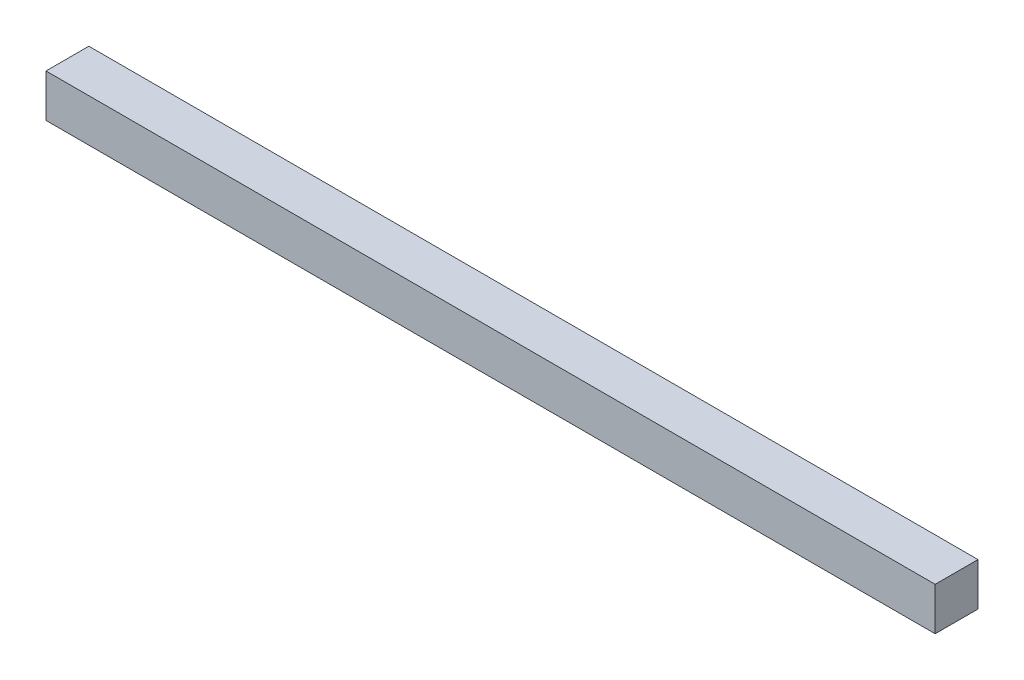
ISO-10303-21;
HEADER;
FILE_DESCRIPTION(('STEP AP214'),'2;1');
FILE_NAME('part.step','',(''),(''),'','','');
FILE_SCHEMA(('AUTOMOTIVE_DESIGN { 1 0 10303 214 1 1 1 1 }'));
ENDSEC;
DATA;
#1=APPLICATION_CONTEXT('core data for automotive mechanical design processes');
#2=APPLICATION_PROTOCOL_DEFINITION('international standard','automotive_design',2000,#1);
#3=PRODUCT_CONTEXT('',#1,'mechanical');
#4=PRODUCT('Part','Part','',(#3));
#5=PRODUCT_RELATED_PRODUCT_CATEGORY('part','',(#4));
#6=PRODUCT_DEFINITION_FORMATION('','',#4);
#7=PRODUCT_DEFINITION_CONTEXT('part definition',#1,'design');
#8=PRODUCT_DEFINITION('design','',#6,#7);
#9=PRODUCT_DEFINITION_SHAPE('','',#8);
#10=(LENGTH_UNIT() NAMED_UNIT(*) SI_UNIT(.MILLI.,.METRE.));
#11=(NAMED_UNIT(*) PLANE_ANGLE_UNIT() SI_UNIT($,.RADIAN.));
#12=(NAMED_UNIT(*) SI_UNIT($,.STERADIAN.) SOLID_ANGLE_UNIT());
#13=UNCERTAINTY_MEASURE_WITH_UNIT(LENGTH_MEASURE(1.E-05),#10,'distance_accuracy_value','');
#14=(GEOMETRIC_REPRESENTATION_CONTEXT(3) GLOBAL_UNCERTAINTY_ASSIGNED_CONTEXT((#13)) GLOBAL_UNIT_ASSIGNED_CONTEXT((#10,
#11,#12)) REPRESENTATION_CONTEXT('',''));
#15=CARTESIAN_POINT('',(0.,0.,0.));
#16=DIRECTION('',(0.,0.,1.));
#17=DIRECTION('',(1.,0.,0.));
#18=AXIS2_PLACEMENT_3D('',#15,#16,#17);
#19=CARTESIAN_POINT('',(0.,5.,0.));
#20=DIRECTION('',(1.,0.,0.));
#21=DIRECTION('',(0.,0.,-1.));
#22=AXIS2_PLACEMENT_3D('',#19,#20,#21);
#23=PLANE('',#22);
#24=DIRECTION('',(0.,0.,1.));
#25=VECTOR('',#24,1.);
#26=CARTESIAN_POINT('',(0.,0.,0.));
#27=LINE('',#26,#25);
#28=CARTESIAN_POINT('',(0.,0.,-5.));
#29=VERTEX_POINT('',#28);
#30=CARTESIAN_POINT('',(0.,0.,0.));
#31=VERTEX_POINT('',#30);
#32=EDGE_CURVE('E96',#29,#31,#27,.T.);
#33=ORIENTED_EDGE('',*,*,#32,.T.);
#34=DIRECTION('',(0.,-1.,0.));
#35=VECTOR('',#34,1.);
#36=CARTESIAN_POINT('',(0.,5.,0.));
#37=LINE('',#36,#35);
#38=CARTESIAN_POINT('',(0.,5.,0.));
#39=VERTEX_POINT('',#38);
#40=EDGE_CURVE('E11',#39,#31,#37,.T.);
#41=ORIENTED_EDGE('',*,*,#40,.F.);
#42=DIRECTION('',(0.,0.,1.));
#43=VECTOR('',#42,1.);
#44=CARTESIAN_POINT('',(0.,5.,0.));
#45=LINE('',#44,#43);
#46=CARTESIAN_POINT('',(0.,5.,-5.));
#47=VERTEX_POINT('',#46);
#48=EDGE_CURVE('E84',#47,#39,#45,.T.);
#49=ORIENTED_EDGE('',*,*,#48,.F.);
#50=DIRECTION('',(0.,-1.,0.));
#51=VECTOR('',#50,1.);
#52=CARTESIAN_POINT('',(0.,5.,-5.));
#53=LINE('',#52,#51);
#54=EDGE_CURVE('E92',#47,#29,#53,.T.);
#55=ORIENTED_EDGE('',*,*,#54,.T.);
#56=EDGE_LOOP('',(#33,#41,#49,#55));
#57=FACE_BOUND('',#56,.T.);
#58=ADVANCED_FACE('F33',(#57),#23,.F.);
#59=CARTESIAN_POINT('',(0.,5.,0.));
#60=DIRECTION('',(0.,0.,-1.));
#61=DIRECTION('',(-1.,0.,0.));
#62=AXIS2_PLACEMENT_3D('',#59,#60,#61);
#63=PLANE('',#62);
#64=DIRECTION('',(1.,0.,0.));
#65=VECTOR('',#64,1.);
#66=CARTESIAN_POINT('',(0.,0.,0.));
#67=LINE('',#66,#65);
#68=CARTESIAN_POINT('',(103.75,0.,0.));
#69=VERTEX_POINT('',#68);
#70=EDGE_CURVE('E88',#31,#69,#67,.T.);
#71=ORIENTED_EDGE('',*,*,#70,.T.);
#72=DIRECTION('',(0.,-1.,0.));
#73=VECTOR('',#72,1.);
#74=CARTESIAN_POINT('',(103.75,5.,0.));
#75=LINE('',#74,#73);
#76=CARTESIAN_POINT('',(103.75,5.,0.));
#77=VERTEX_POINT('',#76);
#78=EDGE_CURVE('E41',#77,#69,#75,.T.);
#79=ORIENTED_EDGE('',*,*,#78,.F.);
#80=DIRECTION('',(1.,0.,0.));
#81=VECTOR('',#80,1.);
#82=CARTESIAN_POINT('',(0.,5.,0.));
#83=LINE('',#82,#81);
#84=EDGE_CURVE('E79',#39,#77,#83,.T.);
#85=ORIENTED_EDGE('',*,*,#84,.F.);
#86=ORIENTED_EDGE('',*,*,#40,.T.);
#87=EDGE_LOOP('',(#71,#79,#85,#86));
#88=FACE_BOUND('',#87,.T.);
#89=ADVANCED_FACE('F87',(#88),#63,.F.);
#90=CARTESIAN_POINT('',(103.75,5.,0.));
#91=DIRECTION('',(-1.,0.,0.));
#92=DIRECTION('',(0.,0.,1.));
#93=AXIS2_PLACEMENT_3D('',#90,#91,#92);
#94=PLANE('',#93);
#95=DIRECTION('',(0.,0.,-1.));
#96=VECTOR('',#95,1.);
#97=CARTESIAN_POINT('',(103.75,0.,0.));
#98=LINE('',#97,#96);
#99=CARTESIAN_POINT('',(103.75,0.,-5.));
#100=VERTEX_POINT('',#99);
#101=EDGE_CURVE('E66',#69,#100,#98,.T.);
#102=ORIENTED_EDGE('',*,*,#101,.T.);
#103=DIRECTION('',(0.,-1.,0.));
#104=VECTOR('',#103,1.);
#105=CARTESIAN_POINT('',(103.75,5.,-5.));
#106=LINE('',#105,#104);
#107=CARTESIAN_POINT('',(103.75,5.,-5.));
#108=VERTEX_POINT('',#107);
#109=EDGE_CURVE('E89',#108,#100,#106,.T.);
#110=ORIENTED_EDGE('',*,*,#109,.F.);
#111=DIRECTION('',(0.,0.,-1.));
#112=VECTOR('',#111,1.);
#113=CARTESIAN_POINT('',(103.75,5.,0.));
#114=LINE('',#113,#112);
#115=EDGE_CURVE('E82',#77,#108,#114,.T.);
#116=ORIENTED_EDGE('',*,*,#115,.F.);
#117=ORIENTED_EDGE('',*,*,#78,.T.);
#118=EDGE_LOOP('',(#102,#110,#116,#117));
#119=FACE_BOUND('',#118,.T.);
#120=ADVANCED_FACE('F90',(#119),#94,.F.);
#121=CARTESIAN_POINT('',(0.,5.,-5.));
#122=DIRECTION('',(0.,0.,1.));
#123=DIRECTION('',(1.,0.,0.));
#124=AXIS2_PLACEMENT_3D('',#121,#122,#123);
#125=PLANE('',#124);
#126=DIRECTION('',(-1.,0.,0.));
#127=VECTOR('',#126,1.);
#128=CARTESIAN_POINT('',(0.,0.,-5.));
#129=LINE('',#128,#127);
#130=EDGE_CURVE('E72',#100,#29,#129,.T.);
#131=ORIENTED_EDGE('',*,*,#130,.T.);
#132=ORIENTED_EDGE('',*,*,#54,.F.);
#133=DIRECTION('',(-1.,0.,0.));
#134=VECTOR('',#133,1.);
#135=CARTESIAN_POINT('',(0.,5.,-5.));
#136=LINE('',#135,#134);
#137=EDGE_CURVE('E49',#108,#47,#136,.T.);
#138=ORIENTED_EDGE('',*,*,#137,.F.);
#139=ORIENTED_EDGE('',*,*,#109,.T.);
#140=EDGE_LOOP('',(#131,#132,#138,#139));
#141=FACE_BOUND('',#140,.T.);
#142=ADVANCED_FACE('F103',(#141),#125,.F.);
#143=CARTESIAN_POINT('',(0.,5.,0.));
#144=DIRECTION('',(0.,-1.,0.));
#145=DIRECTION('',(0.,0.,-1.));
#146=AXIS2_PLACEMENT_3D('',#143,#144,#145);
#147=PLANE('',#146);
#148=ORIENTED_EDGE('',*,*,#48,.T.);
#149=ORIENTED_EDGE('',*,*,#84,.T.);
#150=ORIENTED_EDGE('',*,*,#115,.T.);
#151=ORIENTED_EDGE('',*,*,#137,.T.);
#152=EDGE_LOOP('',(#148,#149,#150,#151));
#153=FACE_BOUND('',#152,.T.);
#154=ADVANCED_FACE('F80',(#153),#147,.F.);
#155=CARTESIAN_POINT('',(0.,0.,0.));
#156=DIRECTION('',(0.,-1.,0.));
#157=DIRECTION('',(0.,0.,-1.));
#158=AXIS2_PLACEMENT_3D('',#155,#156,#157);
#159=PLANE('',#158);
#160=ORIENTED_EDGE('',*,*,#32,.F.);
#161=ORIENTED_EDGE('',*,*,#130,.F.);
#162=ORIENTED_EDGE('',*,*,#101,.F.);
#163=ORIENTED_EDGE('',*,*,#70,.F.);
#164=EDGE_LOOP('',(#160,#161,#162,#163));
#165=FACE_BOUND('',#164,.T.);
#166=ADVANCED_FACE('F106',(#165),#159,.T.);
#167=CLOSED_SHELL('',(#58,#89,#120,#142,#154,#166));
#168=MANIFOLD_SOLID_BREP('B2',#167);
#169=ADVANCED_BREP_SHAPE_REPRESENTATION('',(#18,#168),#14);
#170=SHAPE_DEFINITION_REPRESENTATION(#9,#169);
ENDSEC;
END-ISO-10303-21;
